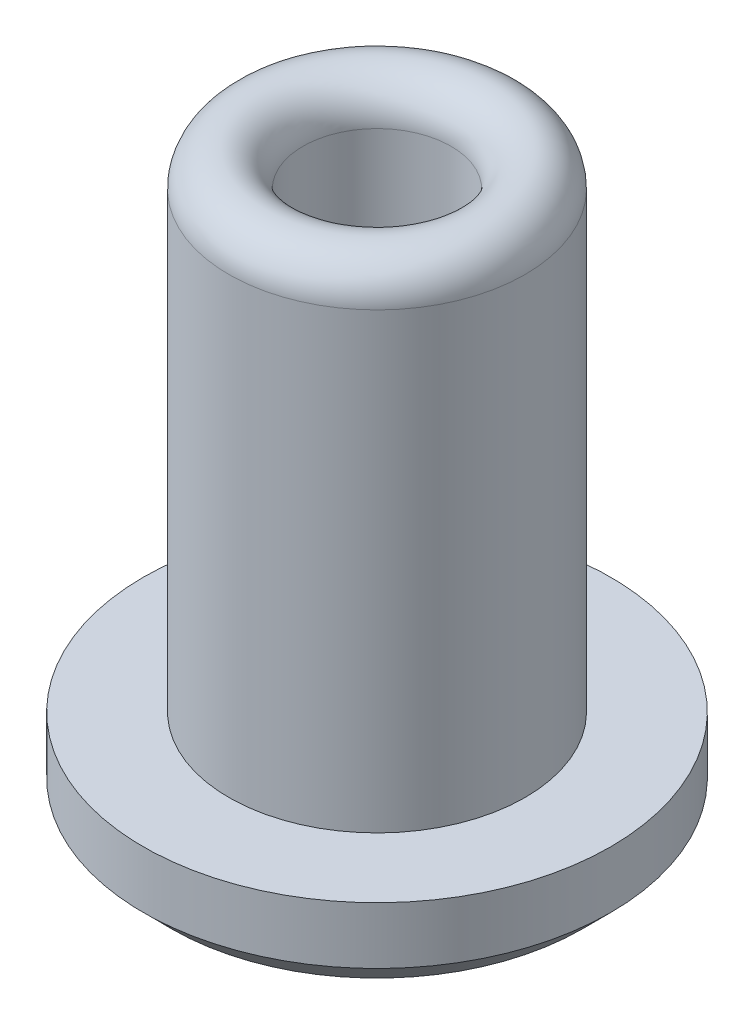
ISO-10303-21;
HEADER;
FILE_DESCRIPTION(('STEP AP214'),'2;1');
FILE_NAME('part.step','',(''),(''),'','','');
FILE_SCHEMA(('AUTOMOTIVE_DESIGN { 1 0 10303 214 1 1 1 1 }'));
ENDSEC;
DATA;
#1=APPLICATION_CONTEXT('core data for automotive mechanical design processes');
#2=APPLICATION_PROTOCOL_DEFINITION('international standard','automotive_design',2000,#1);
#3=PRODUCT_CONTEXT('',#1,'mechanical');
#4=PRODUCT('Part','Part','',(#3));
#5=PRODUCT_RELATED_PRODUCT_CATEGORY('part','',(#4));
#6=PRODUCT_DEFINITION_FORMATION('','',#4);
#7=PRODUCT_DEFINITION_CONTEXT('part definition',#1,'design');
#8=PRODUCT_DEFINITION('design','',#6,#7);
#9=PRODUCT_DEFINITION_SHAPE('','',#8);
#10=(LENGTH_UNIT() NAMED_UNIT(*) SI_UNIT(.MILLI.,.METRE.));
#11=(NAMED_UNIT(*) PLANE_ANGLE_UNIT() SI_UNIT($,.RADIAN.));
#12=(NAMED_UNIT(*) SI_UNIT($,.STERADIAN.) SOLID_ANGLE_UNIT());
#13=UNCERTAINTY_MEASURE_WITH_UNIT(LENGTH_MEASURE(1.E-05),#10,'distance_accuracy_value','');
#14=(GEOMETRIC_REPRESENTATION_CONTEXT(3) GLOBAL_UNCERTAINTY_ASSIGNED_CONTEXT((#13)) GLOBAL_UNIT_ASSIGNED_CONTEXT((#10,
#11,#12)) REPRESENTATION_CONTEXT('',''));
#15=CARTESIAN_POINT('',(0.,0.,0.));
#16=DIRECTION('',(0.,0.,1.));
#17=DIRECTION('',(1.,0.,0.));
#18=AXIS2_PLACEMENT_3D('',#15,#16,#17);
#19=CARTESIAN_POINT('',(-4.1,0.,0.));
#20=DIRECTION('',(0.,1.,0.));
#21=DIRECTION('',(-1.,0.,0.));
#22=AXIS2_PLACEMENT_3D('',#19,#20,#21);
#23=PLANE('',#22);
#24=CARTESIAN_POINT('',(0.,0.,0.));
#25=DIRECTION('',(0.,1.,0.));
#26=DIRECTION('',(-1.,0.,0.));
#27=AXIS2_PLACEMENT_3D('',#24,#25,#26);
#28=CIRCLE('',#27,3.59999999999991);
#29=CARTESIAN_POINT('',(-3.59999999999991,0.,0.));
#30=VERTEX_POINT('',#29);
#31=EDGE_CURVE('E39',#30,#30,#28,.F.);
#32=ORIENTED_EDGE('',*,*,#31,.T.);
#33=EDGE_LOOP('',(#32));
#34=FACE_BOUND('',#33,.T.);
#35=ADVANCED_FACE('F32',(#34),#23,.F.);
#36=CARTESIAN_POINT('',(-0.299999999999999,0.5,0.));
#37=DIRECTION('',(0.,-1.,0.));
#38=DIRECTION('',(1.,0.,0.));
#39=AXIS2_PLACEMENT_3D('',#36,#37,#38);
#40=PLANE('',#39);
#41=CARTESIAN_POINT('',(0.,0.499999999999945,0.));
#42=DIRECTION('',(0.,-1.,0.));
#43=DIRECTION('',(1.,0.,0.));
#44=AXIS2_PLACEMENT_3D('',#41,#42,#43);
#45=CIRCLE('',#44,0.299999999999997);
#46=CARTESIAN_POINT('',(0.299999999999995,0.499999999999946,0.));
#47=VERTEX_POINT('',#46);
#48=EDGE_CURVE('E43',#47,#47,#45,.T.);
#49=ORIENTED_EDGE('',*,*,#48,.F.);
#50=EDGE_LOOP('',(#49));
#51=FACE_BOUND('',#50,.T.);
#52=ADVANCED_FACE('F94',(#51),#40,.F.);
#53=CARTESIAN_POINT('',(0.,1.5,0.));
#54=DIRECTION('',(0.,-1.,0.));
#55=DIRECTION('',(1.,0.,0.));
#56=AXIS2_PLACEMENT_3D('',#53,#54,#55);
#57=DEGENERATE_TOROIDAL_SURFACE('',#56,0.299999999999993,1.,.T.);
#58=CARTESIAN_POINT('',(0.,1.50000000000006,0.));
#59=DIRECTION('',(0.,-1.,0.));
#60=DIRECTION('',(1.,0.,0.));
#61=AXIS2_PLACEMENT_3D('',#58,#59,#60);
#62=CIRCLE('',#61,1.29999999999999);
#63=CARTESIAN_POINT('',(1.29999999999999,1.50000000000006,0.));
#64=VERTEX_POINT('',#63);
#65=EDGE_CURVE('E47',#64,#64,#62,.T.);
#66=ORIENTED_EDGE('',*,*,#65,.F.);
#67=EDGE_LOOP('',(#66));
#68=FACE_BOUND('',#67,.T.);
#69=ORIENTED_EDGE('',*,*,#48,.T.);
#70=EDGE_LOOP('',(#69));
#71=FACE_BOUND('',#70,.T.);
#72=ADVANCED_FACE('F88',(#68,#71),#57,.F.);
#73=CARTESIAN_POINT('',(3.49148133884313E-12,-1000.,0.));
#74=DIRECTION('',(0.,-1.,0.));
#75=DIRECTION('',(1.,0.,0.));
#76=AXIS2_PLACEMENT_3D('',#73,#74,#75);
#77=CYLINDRICAL_SURFACE('',#76,1.29999999999998);
#78=CARTESIAN_POINT('',(0.,9.44999999999996,0.));
#79=DIRECTION('',(0.,-1.,0.));
#80=DIRECTION('',(1.,0.,0.));
#81=AXIS2_PLACEMENT_3D('',#78,#79,#80);
#82=CIRCLE('',#81,1.29999999999997);
#83=CARTESIAN_POINT('',(1.29999999999993,9.44999999999996,0.));
#84=VERTEX_POINT('',#83);
#85=EDGE_CURVE('E52',#84,#84,#82,.T.);
#86=ORIENTED_EDGE('',*,*,#85,.F.);
#87=EDGE_LOOP('',(#86));
#88=FACE_BOUND('',#87,.T.);
#89=ORIENTED_EDGE('',*,*,#65,.T.);
#90=EDGE_LOOP('',(#89));
#91=FACE_BOUND('',#90,.T.);
#92=ADVANCED_FACE('F82',(#88,#91),#77,.F.);
#93=CARTESIAN_POINT('',(0.,9.45,0.));
#94=DIRECTION('',(0.,-1.,0.));
#95=DIRECTION('',(1.,0.,0.));
#96=AXIS2_PLACEMENT_3D('',#93,#94,#95);
#97=TOROIDAL_SURFACE('',#96,1.94999999999997,0.65);
#98=CARTESIAN_POINT('',(0.,9.44999999999996,0.));
#99=DIRECTION('',(0.,-1.,0.));
#100=DIRECTION('',(1.,0.,0.));
#101=AXIS2_PLACEMENT_3D('',#98,#99,#100);
#102=CIRCLE('',#101,2.59999999999997);
#103=CARTESIAN_POINT('',(2.59999999999993,9.44999999999997,0.));
#104=VERTEX_POINT('',#103);
#105=EDGE_CURVE('E55',#104,#104,#102,.T.);
#106=ORIENTED_EDGE('',*,*,#105,.F.);
#107=EDGE_LOOP('',(#106));
#108=FACE_BOUND('',#107,.T.);
#109=ORIENTED_EDGE('',*,*,#85,.T.);
#110=EDGE_LOOP('',(#109));
#111=FACE_BOUND('',#110,.T.);
#112=ADVANCED_FACE('F76',(#108,#111),#97,.T.);
#113=CARTESIAN_POINT('',(3.49148133884313E-12,-1000.,0.));
#114=DIRECTION('',(0.,-1.,0.));
#115=DIRECTION('',(1.,0.,0.));
#116=AXIS2_PLACEMENT_3D('',#113,#114,#115);
#117=CYLINDRICAL_SURFACE('',#116,2.59999999999998);
#118=CARTESIAN_POINT('',(0.,1.50000000000006,0.));
#119=DIRECTION('',(0.,-1.,0.));
#120=DIRECTION('',(1.,0.,0.));
#121=AXIS2_PLACEMENT_3D('',#118,#119,#120);
#122=CIRCLE('',#121,2.59999999999999);
#123=CARTESIAN_POINT('',(2.59999999999999,1.50000000000007,0.));
#124=VERTEX_POINT('',#123);
#125=EDGE_CURVE('E58',#124,#124,#122,.T.);
#126=ORIENTED_EDGE('',*,*,#125,.F.);
#127=EDGE_LOOP('',(#126));
#128=FACE_BOUND('',#127,.T.);
#129=ORIENTED_EDGE('',*,*,#105,.T.);
#130=EDGE_LOOP('',(#129));
#131=FACE_BOUND('',#130,.T.);
#132=ADVANCED_FACE('F70',(#128,#131),#117,.T.);
#133=CARTESIAN_POINT('',(-2.6,1.5,0.));
#134=DIRECTION('',(0.,-1.,0.));
#135=DIRECTION('',(1.,0.,0.));
#136=AXIS2_PLACEMENT_3D('',#133,#134,#135);
#137=PLANE('',#136);
#138=CARTESIAN_POINT('',(0.,1.50000000000006,0.));
#139=DIRECTION('',(0.,-1.,0.));
#140=DIRECTION('',(1.,0.,0.));
#141=AXIS2_PLACEMENT_3D('',#138,#139,#140);
#142=CIRCLE('',#141,4.09999999999999);
#143=CARTESIAN_POINT('',(4.09999999999999,1.50000000000007,0.));
#144=VERTEX_POINT('',#143);
#145=EDGE_CURVE('E61',#144,#144,#142,.T.);
#146=ORIENTED_EDGE('',*,*,#145,.F.);
#147=EDGE_LOOP('',(#146));
#148=FACE_BOUND('',#147,.T.);
#149=ORIENTED_EDGE('',*,*,#125,.T.);
#150=EDGE_LOOP('',(#149));
#151=FACE_BOUND('',#150,.T.);
#152=ADVANCED_FACE('F67',(#148,#151),#137,.F.);
#153=CARTESIAN_POINT('',(3.49148133884313E-12,-1000.,0.));
#154=DIRECTION('',(0.,-1.,0.));
#155=DIRECTION('',(1.,0.,0.));
#156=AXIS2_PLACEMENT_3D('',#153,#154,#155);
#157=CYLINDRICAL_SURFACE('',#156,4.1);
#158=CARTESIAN_POINT('',(0.,0.500000000000167,0.));
#159=DIRECTION('',(0.,1.,0.));
#160=DIRECTION('',(-1.,0.,0.));
#161=AXIS2_PLACEMENT_3D('',#158,#159,#160);
#162=CIRCLE('',#161,4.1);
#163=CARTESIAN_POINT('',(-4.1,0.500000000000153,0.));
#164=VERTEX_POINT('',#163);
#165=EDGE_CURVE('E10',#164,#164,#162,.T.);
#166=ORIENTED_EDGE('',*,*,#165,.T.);
#167=EDGE_LOOP('',(#166));
#168=FACE_BOUND('',#167,.T.);
#169=ORIENTED_EDGE('',*,*,#145,.T.);
#170=EDGE_LOOP('',(#169));
#171=FACE_BOUND('',#170,.T.);
#172=ADVANCED_FACE('F65',(#168,#171),#157,.T.);
#173=CARTESIAN_POINT('',(0.,0.,0.));
#174=DIRECTION('',(0.,1.,0.));
#175=DIRECTION('',(-1.,0.,0.));
#176=AXIS2_PLACEMENT_3D('',#173,#174,#175);
#177=CONICAL_SURFACE('',#176,3.59999999999991,0.785398163397372);
#178=ORIENTED_EDGE('',*,*,#165,.F.);
#179=EDGE_LOOP('',(#178));
#180=FACE_BOUND('',#179,.T.);
#181=ORIENTED_EDGE('',*,*,#31,.F.);
#182=EDGE_LOOP('',(#181));
#183=FACE_BOUND('',#182,.T.);
#184=ADVANCED_FACE('F34',(#180,#183),#177,.T.);
#185=CLOSED_SHELL('',(#35,#52,#72,#92,#112,#132,#152,#172,#184));
#186=MANIFOLD_SOLID_BREP('B2',#185);
#187=ADVANCED_BREP_SHAPE_REPRESENTATION('',(#18,#186),#14);
#188=SHAPE_DEFINITION_REPRESENTATION(#9,#187);
ENDSEC;
END-ISO-10303-21;
